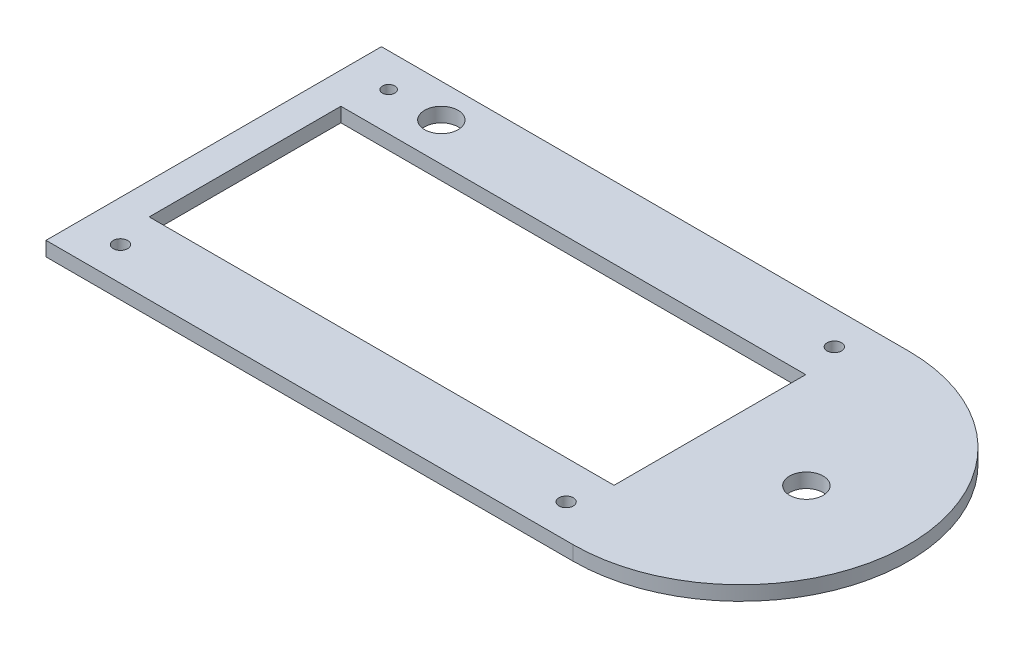
ISO-10303-21;
HEADER;
FILE_DESCRIPTION(('STEP AP214'),'2;1');
FILE_NAME('part.step','',(''),(''),'','','');
FILE_SCHEMA(('AUTOMOTIVE_DESIGN { 1 0 10303 214 1 1 1 1 }'));
ENDSEC;
DATA;
#1=APPLICATION_CONTEXT('core data for automotive mechanical design processes');
#2=APPLICATION_PROTOCOL_DEFINITION('international standard','automotive_design',2000,#1);
#3=PRODUCT_CONTEXT('',#1,'mechanical');
#4=PRODUCT('Part','Part','',(#3));
#5=PRODUCT_RELATED_PRODUCT_CATEGORY('part','',(#4));
#6=PRODUCT_DEFINITION_FORMATION('','',#4);
#7=PRODUCT_DEFINITION_CONTEXT('part definition',#1,'design');
#8=PRODUCT_DEFINITION('design','',#6,#7);
#9=PRODUCT_DEFINITION_SHAPE('','',#8);
#10=(LENGTH_UNIT() NAMED_UNIT(*) SI_UNIT(.MILLI.,.METRE.));
#11=(NAMED_UNIT(*) PLANE_ANGLE_UNIT() SI_UNIT($,.RADIAN.));
#12=(NAMED_UNIT(*) SI_UNIT($,.STERADIAN.) SOLID_ANGLE_UNIT());
#13=UNCERTAINTY_MEASURE_WITH_UNIT(LENGTH_MEASURE(1.E-05),#10,'distance_accuracy_value','');
#14=(GEOMETRIC_REPRESENTATION_CONTEXT(3) GLOBAL_UNCERTAINTY_ASSIGNED_CONTEXT((#13)) GLOBAL_UNIT_ASSIGNED_CONTEXT((#10,
#11,#12)) REPRESENTATION_CONTEXT('',''));
#15=CARTESIAN_POINT('',(0.,0.,0.));
#16=DIRECTION('',(0.,0.,1.));
#17=DIRECTION('',(1.,0.,0.));
#18=AXIS2_PLACEMENT_3D('',#15,#16,#17);
#19=CARTESIAN_POINT('',(0.,3.,-6.97895276201306));
#20=DIRECTION('',(0.,0.,-1.));
#21=DIRECTION('',(-1.,0.,0.));
#22=AXIS2_PLACEMENT_3D('',#19,#20,#21);
#23=PLANE('',#22);
#24=DIRECTION('',(1.,0.,0.));
#25=VECTOR('',#24,1.);
#26=CARTESIAN_POINT('',(0.,0.,-6.97895276201306));
#27=LINE('',#26,#25);
#28=CARTESIAN_POINT('',(-60.8951195522196,0.,-6.97895276201306));
#29=VERTEX_POINT('',#28);
#30=CARTESIAN_POINT('',(36.1048804477804,0.,-6.97895276201306));
#31=VERTEX_POINT('',#30);
#32=EDGE_CURVE('E160',#29,#31,#27,.T.);
#33=ORIENTED_EDGE('',*,*,#32,.T.);
#34=DIRECTION('',(0.,-1.,0.));
#35=VECTOR('',#34,1.);
#36=CARTESIAN_POINT('',(36.1048804477804,3.,-6.97895276201306));
#37=LINE('',#36,#35);
#38=CARTESIAN_POINT('',(36.1048804477804,3.,-6.97895276201306));
#39=VERTEX_POINT('',#38);
#40=EDGE_CURVE('E11',#39,#31,#37,.T.);
#41=ORIENTED_EDGE('',*,*,#40,.F.);
#42=DIRECTION('',(1.,0.,0.));
#43=VECTOR('',#42,1.);
#44=CARTESIAN_POINT('',(0.,3.,-6.97895276201306));
#45=LINE('',#44,#43);
#46=CARTESIAN_POINT('',(-60.8951195522196,3.,-6.97895276201306));
#47=VERTEX_POINT('',#46);
#48=EDGE_CURVE('E113',#47,#39,#45,.T.);
#49=ORIENTED_EDGE('',*,*,#48,.F.);
#50=DIRECTION('',(0.,-1.,0.));
#51=VECTOR('',#50,1.);
#52=CARTESIAN_POINT('',(-60.8951195522196,3.,-6.97895276201306));
#53=LINE('',#52,#51);
#54=EDGE_CURVE('E53',#47,#29,#53,.T.);
#55=ORIENTED_EDGE('',*,*,#54,.T.);
#56=EDGE_LOOP('',(#33,#41,#49,#55));
#57=FACE_BOUND('',#56,.T.);
#58=ADVANCED_FACE('F34',(#57),#23,.F.);
#59=CARTESIAN_POINT('',(36.1048804477804,3.,0.));
#60=DIRECTION('',(1.,0.,0.));
#61=DIRECTION('',(0.,0.,-1.));
#62=AXIS2_PLACEMENT_3D('',#59,#60,#61);
#63=PLANE('',#62);
#64=DIRECTION('',(0.,0.,1.));
#65=VECTOR('',#64,1.);
#66=CARTESIAN_POINT('',(36.1048804477804,0.,0.));
#67=LINE('',#66,#65);
#68=CARTESIAN_POINT('',(36.1048804477804,0.,33.0210472379869));
#69=VERTEX_POINT('',#68);
#70=EDGE_CURVE('E119',#31,#69,#67,.T.);
#71=ORIENTED_EDGE('',*,*,#70,.T.);
#72=DIRECTION('',(0.,-1.,0.));
#73=VECTOR('',#72,1.);
#74=CARTESIAN_POINT('',(36.1048804477804,3.,33.0210472379869));
#75=LINE('',#74,#73);
#76=CARTESIAN_POINT('',(36.1048804477804,3.,33.0210472379869));
#77=VERTEX_POINT('',#76);
#78=EDGE_CURVE('E44',#77,#69,#75,.T.);
#79=ORIENTED_EDGE('',*,*,#78,.F.);
#80=DIRECTION('',(0.,0.,1.));
#81=VECTOR('',#80,1.);
#82=CARTESIAN_POINT('',(36.1048804477804,3.,0.));
#83=LINE('',#82,#81);
#84=EDGE_CURVE('E107',#39,#77,#83,.T.);
#85=ORIENTED_EDGE('',*,*,#84,.F.);
#86=ORIENTED_EDGE('',*,*,#40,.T.);
#87=EDGE_LOOP('',(#71,#79,#85,#86));
#88=FACE_BOUND('',#87,.T.);
#89=ADVANCED_FACE('F118',(#88),#63,.F.);
#90=CARTESIAN_POINT('',(0.,3.,33.0210472379869));
#91=DIRECTION('',(0.,0.,-1.));
#92=DIRECTION('',(-1.,0.,0.));
#93=AXIS2_PLACEMENT_3D('',#90,#91,#92);
#94=PLANE('',#93);
#95=DIRECTION('',(1.,0.,0.));
#96=VECTOR('',#95,1.);
#97=CARTESIAN_POINT('',(0.,0.,33.0210472379869));
#98=LINE('',#97,#96);
#99=CARTESIAN_POINT('',(-60.8951195522196,0.,33.0210472379869));
#100=VERTEX_POINT('',#99);
#101=EDGE_CURVE('E163',#100,#69,#98,.T.);
#102=ORIENTED_EDGE('',*,*,#101,.F.);
#103=DIRECTION('',(0.,-1.,0.));
#104=VECTOR('',#103,1.);
#105=CARTESIAN_POINT('',(-60.8951195522196,3.,33.0210472379869));
#106=LINE('',#105,#104);
#107=CARTESIAN_POINT('',(-60.8951195522196,3.,33.0210472379869));
#108=VERTEX_POINT('',#107);
#109=EDGE_CURVE('E79',#108,#100,#106,.T.);
#110=ORIENTED_EDGE('',*,*,#109,.F.);
#111=DIRECTION('',(1.,0.,0.));
#112=VECTOR('',#111,1.);
#113=CARTESIAN_POINT('',(0.,3.,33.0210472379869));
#114=LINE('',#113,#112);
#115=EDGE_CURVE('E112',#108,#77,#114,.T.);
#116=ORIENTED_EDGE('',*,*,#115,.T.);
#117=ORIENTED_EDGE('',*,*,#78,.T.);
#118=EDGE_LOOP('',(#102,#110,#116,#117));
#119=FACE_BOUND('',#118,.T.);
#120=ADVANCED_FACE('F123',(#119),#94,.T.);
#121=CARTESIAN_POINT('',(42.5682801600808,3.,13.0210472379869));
#122=DIRECTION('',(0.,-1.,0.));
#123=DIRECTION('',(0.,0.,-1.));
#124=AXIS2_PLACEMENT_3D('',#121,#122,#123);
#125=CYLINDRICAL_SURFACE('',#124,35.);
#126=CARTESIAN_POINT('',(42.5682801600808,0.,13.0210472379869));
#127=DIRECTION('',(0.,1.,0.));
#128=DIRECTION('',(0.,0.,1.));
#129=AXIS2_PLACEMENT_3D('',#126,#127,#128);
#130=CIRCLE('',#129,35.);
#131=CARTESIAN_POINT('',(42.5682801600808,0.,-21.9789527620131));
#132=VERTEX_POINT('',#131);
#133=CARTESIAN_POINT('',(42.5682801600808,0.,48.0210472379869));
#134=VERTEX_POINT('',#133);
#135=EDGE_CURVE('E145',#132,#134,#130,.F.);
#136=ORIENTED_EDGE('',*,*,#135,.F.);
#137=DIRECTION('',(0.,-1.,0.));
#138=VECTOR('',#137,1.);
#139=CARTESIAN_POINT('',(42.5682801600808,3.,-21.9789527620131));
#140=LINE('',#139,#138);
#141=CARTESIAN_POINT('',(42.5682801600808,3.,-21.9789527620131));
#142=VERTEX_POINT('',#141);
#143=EDGE_CURVE('E38',#142,#132,#140,.T.);
#144=ORIENTED_EDGE('',*,*,#143,.F.);
#145=CARTESIAN_POINT('',(42.5682801600808,3.,13.0210472379869));
#146=DIRECTION('',(0.,1.,0.));
#147=DIRECTION('',(0.,0.,1.));
#148=AXIS2_PLACEMENT_3D('',#145,#146,#147);
#149=CIRCLE('',#148,35.);
#150=CARTESIAN_POINT('',(42.5682801600808,3.,48.0210472379869));
#151=VERTEX_POINT('',#150);
#152=EDGE_CURVE('E201',#142,#151,#149,.F.);
#153=ORIENTED_EDGE('',*,*,#152,.T.);
#154=DIRECTION('',(0.,-1.,0.));
#155=VECTOR('',#154,1.);
#156=CARTESIAN_POINT('',(42.5682801600808,3.,48.0210472379869));
#157=LINE('',#156,#155);
#158=EDGE_CURVE('E126',#151,#134,#157,.T.);
#159=ORIENTED_EDGE('',*,*,#158,.T.);
#160=EDGE_LOOP('',(#136,#144,#153,#159));
#161=FACE_BOUND('',#160,.T.);
#162=ADVANCED_FACE('F184',(#161),#125,.T.);
#163=CARTESIAN_POINT('',(0.,3.,-21.9789527620131));
#164=DIRECTION('',(0.,0.,-1.));
#165=DIRECTION('',(-1.,0.,0.));
#166=AXIS2_PLACEMENT_3D('',#163,#164,#165);
#167=PLANE('',#166);
#168=DIRECTION('',(1.,0.,0.));
#169=VECTOR('',#168,1.);
#170=CARTESIAN_POINT('',(0.,0.,-21.9789527620131));
#171=LINE('',#170,#169);
#172=CARTESIAN_POINT('',(-67.4317198399193,0.,-21.9789527620131));
#173=VERTEX_POINT('',#172);
#174=EDGE_CURVE('E148',#173,#132,#171,.T.);
#175=ORIENTED_EDGE('',*,*,#174,.F.);
#176=DIRECTION('',(0.,-1.,0.));
#177=VECTOR('',#176,1.);
#178=CARTESIAN_POINT('',(-67.4317198399193,3.,-21.9789527620131));
#179=LINE('',#178,#177);
#180=CARTESIAN_POINT('',(-67.4317198399193,3.,-21.9789527620131));
#181=VERTEX_POINT('',#180);
#182=EDGE_CURVE('E174',#181,#173,#179,.T.);
#183=ORIENTED_EDGE('',*,*,#182,.F.);
#184=DIRECTION('',(1.,0.,0.));
#185=VECTOR('',#184,1.);
#186=CARTESIAN_POINT('',(0.,3.,-21.9789527620131));
#187=LINE('',#186,#185);
#188=EDGE_CURVE('E183',#181,#142,#187,.T.);
#189=ORIENTED_EDGE('',*,*,#188,.T.);
#190=ORIENTED_EDGE('',*,*,#143,.T.);
#191=EDGE_LOOP('',(#175,#183,#189,#190));
#192=FACE_BOUND('',#191,.T.);
#193=ADVANCED_FACE('F181',(#192),#167,.T.);
#194=CARTESIAN_POINT('',(-67.4317198399193,3.,0.));
#195=DIRECTION('',(1.,0.,0.));
#196=DIRECTION('',(0.,0.,-1.));
#197=AXIS2_PLACEMENT_3D('',#194,#195,#196);
#198=PLANE('',#197);
#199=DIRECTION('',(0.,0.,1.));
#200=VECTOR('',#199,1.);
#201=CARTESIAN_POINT('',(-67.4317198399193,0.,0.));
#202=LINE('',#201,#200);
#203=CARTESIAN_POINT('',(-67.4317198399192,0.,48.0210472379869));
#204=VERTEX_POINT('',#203);
#205=EDGE_CURVE('E151',#173,#204,#202,.T.);
#206=ORIENTED_EDGE('',*,*,#205,.T.);
#207=DIRECTION('',(0.,-1.,0.));
#208=VECTOR('',#207,1.);
#209=CARTESIAN_POINT('',(-67.4317198399192,3.,48.0210472379869));
#210=LINE('',#209,#208);
#211=CARTESIAN_POINT('',(-67.4317198399192,3.,48.0210472379869));
#212=VERTEX_POINT('',#211);
#213=EDGE_CURVE('E172',#212,#204,#210,.T.);
#214=ORIENTED_EDGE('',*,*,#213,.F.);
#215=DIRECTION('',(0.,0.,1.));
#216=VECTOR('',#215,1.);
#217=CARTESIAN_POINT('',(-67.4317198399193,3.,0.));
#218=LINE('',#217,#216);
#219=EDGE_CURVE('E192',#181,#212,#218,.T.);
#220=ORIENTED_EDGE('',*,*,#219,.F.);
#221=ORIENTED_EDGE('',*,*,#182,.T.);
#222=EDGE_LOOP('',(#206,#214,#220,#221));
#223=FACE_BOUND('',#222,.T.);
#224=ADVANCED_FACE('F190',(#223),#198,.F.);
#225=CARTESIAN_POINT('',(-58.9317198399192,3.,-14.9789527620131));
#226=DIRECTION('',(0.,-1.,0.));
#227=DIRECTION('',(0.,0.,-1.));
#228=AXIS2_PLACEMENT_3D('',#225,#226,#227);
#229=CYLINDRICAL_SURFACE('',#228,1.29999999999999);
#230=CARTESIAN_POINT('',(-58.9317198399192,3.,-14.9789527620131));
#231=DIRECTION('',(0.,1.,0.));
#232=DIRECTION('',(0.,0.,1.));
#233=AXIS2_PLACEMENT_3D('',#230,#231,#232);
#234=CIRCLE('',#233,1.29999999999999);
#235=CARTESIAN_POINT('',(-58.9317198399192,3.,-13.6789527620131));
#236=VERTEX_POINT('',#235);
#237=EDGE_CURVE('E197',#236,#236,#234,.T.);
#238=ORIENTED_EDGE('',*,*,#237,.T.);
#239=EDGE_LOOP('',(#238));
#240=FACE_BOUND('',#239,.T.);
#241=CARTESIAN_POINT('',(-58.9317198399192,0.,-14.9789527620131));
#242=DIRECTION('',(0.,1.,0.));
#243=DIRECTION('',(0.,0.,1.));
#244=AXIS2_PLACEMENT_3D('',#241,#242,#243);
#245=CIRCLE('',#244,1.29999999999999);
#246=CARTESIAN_POINT('',(-58.9317198399192,0.,-13.6789527620131));
#247=VERTEX_POINT('',#246);
#248=EDGE_CURVE('E157',#247,#247,#245,.T.);
#249=ORIENTED_EDGE('',*,*,#248,.F.);
#250=EDGE_LOOP('',(#249));
#251=FACE_BOUND('',#250,.T.);
#252=ADVANCED_FACE('F208',(#240,#251),#229,.F.);
#253=CARTESIAN_POINT('',(0.,3.,48.0210472379869));
#254=DIRECTION('',(0.,0.,-1.));
#255=DIRECTION('',(-1.,0.,0.));
#256=AXIS2_PLACEMENT_3D('',#253,#254,#255);
#257=PLANE('',#256);
#258=DIRECTION('',(1.,0.,0.));
#259=VECTOR('',#258,1.);
#260=CARTESIAN_POINT('',(0.,0.,48.0210472379869));
#261=LINE('',#260,#259);
#262=EDGE_CURVE('E154',#204,#134,#261,.T.);
#263=ORIENTED_EDGE('',*,*,#262,.T.);
#264=ORIENTED_EDGE('',*,*,#158,.F.);
#265=DIRECTION('',(1.,0.,0.));
#266=VECTOR('',#265,1.);
#267=CARTESIAN_POINT('',(0.,3.,48.0210472379869));
#268=LINE('',#267,#266);
#269=EDGE_CURVE('E195',#212,#151,#268,.T.);
#270=ORIENTED_EDGE('',*,*,#269,.F.);
#271=ORIENTED_EDGE('',*,*,#213,.T.);
#272=EDGE_LOOP('',(#263,#264,#270,#271));
#273=FACE_BOUND('',#272,.T.);
#274=ADVANCED_FACE('F194',(#273),#257,.F.);
#275=CARTESIAN_POINT('',(34.0682801600808,3.,-14.9789527620131));
#276=DIRECTION('',(0.,-1.,0.));
#277=DIRECTION('',(0.,0.,-1.));
#278=AXIS2_PLACEMENT_3D('',#275,#276,#277);
#279=CYLINDRICAL_SURFACE('',#278,1.5);
#280=CARTESIAN_POINT('',(34.0682801600808,3.,-14.9789527620131));
#281=DIRECTION('',(0.,1.,0.));
#282=DIRECTION('',(0.,0.,1.));
#283=AXIS2_PLACEMENT_3D('',#280,#281,#282);
#284=CIRCLE('',#283,1.5);
#285=CARTESIAN_POINT('',(34.0682801600808,3.,-13.4789527620131));
#286=VERTEX_POINT('',#285);
#287=EDGE_CURVE('E284',#286,#286,#284,.T.);
#288=ORIENTED_EDGE('',*,*,#287,.T.);
#289=EDGE_LOOP('',(#288));
#290=FACE_BOUND('',#289,.T.);
#291=CARTESIAN_POINT('',(34.0682801600808,0.,-14.9789527620131));
#292=DIRECTION('',(0.,1.,0.));
#293=DIRECTION('',(0.,0.,1.));
#294=AXIS2_PLACEMENT_3D('',#291,#292,#293);
#295=CIRCLE('',#294,1.5);
#296=CARTESIAN_POINT('',(34.0682801600808,0.,-13.4789527620131));
#297=VERTEX_POINT('',#296);
#298=EDGE_CURVE('E142',#297,#297,#295,.T.);
#299=ORIENTED_EDGE('',*,*,#298,.F.);
#300=EDGE_LOOP('',(#299));
#301=FACE_BOUND('',#300,.T.);
#302=ADVANCED_FACE('F235',(#290,#301),#279,.F.);
#303=CARTESIAN_POINT('',(-58.8951195522196,3.,41.0210352774405));
#304=DIRECTION('',(0.,-1.,0.));
#305=DIRECTION('',(0.,0.,-1.));
#306=AXIS2_PLACEMENT_3D('',#303,#304,#305);
#307=CYLINDRICAL_SURFACE('',#306,1.5);
#308=CARTESIAN_POINT('',(-58.8951195522196,3.,41.0210352774405));
#309=DIRECTION('',(0.,1.,0.));
#310=DIRECTION('',(0.,0.,1.));
#311=AXIS2_PLACEMENT_3D('',#308,#309,#310);
#312=CIRCLE('',#311,1.5);
#313=CARTESIAN_POINT('',(-58.8951195522196,3.,42.5210352774405));
#314=VERTEX_POINT('',#313);
#315=EDGE_CURVE('E277',#314,#314,#312,.T.);
#316=ORIENTED_EDGE('',*,*,#315,.T.);
#317=EDGE_LOOP('',(#316));
#318=FACE_BOUND('',#317,.T.);
#319=CARTESIAN_POINT('',(-58.8951195522196,0.,41.0210352774405));
#320=DIRECTION('',(0.,1.,0.));
#321=DIRECTION('',(0.,0.,1.));
#322=AXIS2_PLACEMENT_3D('',#319,#320,#321);
#323=CIRCLE('',#322,1.5);
#324=CARTESIAN_POINT('',(-58.8951195522196,0.,42.5210352774405));
#325=VERTEX_POINT('',#324);
#326=EDGE_CURVE('E139',#325,#325,#323,.T.);
#327=ORIENTED_EDGE('',*,*,#326,.F.);
#328=EDGE_LOOP('',(#327));
#329=FACE_BOUND('',#328,.T.);
#330=ADVANCED_FACE('F244',(#318,#329),#307,.F.);
#331=CARTESIAN_POINT('',(34.1048804477804,3.,41.0210352774405));
#332=DIRECTION('',(0.,-1.,0.));
#333=DIRECTION('',(0.,0.,-1.));
#334=AXIS2_PLACEMENT_3D('',#331,#332,#333);
#335=CYLINDRICAL_SURFACE('',#334,1.5);
#336=CARTESIAN_POINT('',(34.1048804477804,3.,41.0210352774405));
#337=DIRECTION('',(0.,1.,0.));
#338=DIRECTION('',(0.,0.,1.));
#339=AXIS2_PLACEMENT_3D('',#336,#337,#338);
#340=CIRCLE('',#339,1.5);
#341=CARTESIAN_POINT('',(34.1048804477804,3.,42.5210352774405));
#342=VERTEX_POINT('',#341);
#343=EDGE_CURVE('E274',#342,#342,#340,.T.);
#344=ORIENTED_EDGE('',*,*,#343,.T.);
#345=EDGE_LOOP('',(#344));
#346=FACE_BOUND('',#345,.T.);
#347=CARTESIAN_POINT('',(34.1048804477804,0.,41.0210352774405));
#348=DIRECTION('',(0.,1.,0.));
#349=DIRECTION('',(0.,0.,1.));
#350=AXIS2_PLACEMENT_3D('',#347,#348,#349);
#351=CIRCLE('',#350,1.5);
#352=CARTESIAN_POINT('',(34.1048804477804,0.,42.5210352774405));
#353=VERTEX_POINT('',#352);
#354=EDGE_CURVE('E136',#353,#353,#351,.T.);
#355=ORIENTED_EDGE('',*,*,#354,.F.);
#356=EDGE_LOOP('',(#355));
#357=FACE_BOUND('',#356,.T.);
#358=ADVANCED_FACE('F248',(#346,#357),#335,.F.);
#359=CARTESIAN_POINT('',(56.2429354444259,3.,13.0210472379869));
#360=DIRECTION('',(0.,-1.,0.));
#361=DIRECTION('',(0.,0.,-1.));
#362=AXIS2_PLACEMENT_3D('',#359,#360,#361);
#363=CYLINDRICAL_SURFACE('',#362,3.5);
#364=CARTESIAN_POINT('',(56.2429354444259,3.,13.0210472379869));
#365=DIRECTION('',(0.,1.,0.));
#366=DIRECTION('',(0.,0.,1.));
#367=AXIS2_PLACEMENT_3D('',#364,#365,#366);
#368=CIRCLE('',#367,3.5);
#369=CARTESIAN_POINT('',(56.2429354444259,3.,16.5210472379869));
#370=VERTEX_POINT('',#369);
#371=EDGE_CURVE('E262',#370,#370,#368,.T.);
#372=ORIENTED_EDGE('',*,*,#371,.T.);
#373=EDGE_LOOP('',(#372));
#374=FACE_BOUND('',#373,.T.);
#375=CARTESIAN_POINT('',(56.2429354444259,0.,13.0210472379869));
#376=DIRECTION('',(0.,1.,0.));
#377=DIRECTION('',(0.,0.,1.));
#378=AXIS2_PLACEMENT_3D('',#375,#376,#377);
#379=CIRCLE('',#378,3.5);
#380=CARTESIAN_POINT('',(56.2429354444259,0.,16.5210472379869));
#381=VERTEX_POINT('',#380);
#382=EDGE_CURVE('E133',#381,#381,#379,.T.);
#383=ORIENTED_EDGE('',*,*,#382,.F.);
#384=EDGE_LOOP('',(#383));
#385=FACE_BOUND('',#384,.T.);
#386=ADVANCED_FACE('F251',(#374,#385),#363,.F.);
#387=CARTESIAN_POINT('',(-47.9317198399192,3.,-14.9789527620131));
#388=DIRECTION('',(0.,-1.,0.));
#389=DIRECTION('',(0.,0.,-1.));
#390=AXIS2_PLACEMENT_3D('',#387,#388,#389);
#391=CYLINDRICAL_SURFACE('',#390,3.5);
#392=CARTESIAN_POINT('',(-47.9317198399192,3.,-14.9789527620131));
#393=DIRECTION('',(0.,1.,0.));
#394=DIRECTION('',(0.,0.,1.));
#395=AXIS2_PLACEMENT_3D('',#392,#393,#394);
#396=CIRCLE('',#395,3.5);
#397=CARTESIAN_POINT('',(-47.9317198399192,3.,-11.4789527620131));
#398=VERTEX_POINT('',#397);
#399=EDGE_CURVE('E168',#398,#398,#396,.T.);
#400=ORIENTED_EDGE('',*,*,#399,.T.);
#401=EDGE_LOOP('',(#400));
#402=FACE_BOUND('',#401,.T.);
#403=CARTESIAN_POINT('',(-47.9317198399192,0.,-14.9789527620131));
#404=DIRECTION('',(0.,1.,0.));
#405=DIRECTION('',(0.,0.,1.));
#406=AXIS2_PLACEMENT_3D('',#403,#404,#405);
#407=CIRCLE('',#406,3.5);
#408=CARTESIAN_POINT('',(-47.9317198399192,0.,-11.4789527620131));
#409=VERTEX_POINT('',#408);
#410=EDGE_CURVE('E130',#409,#409,#407,.T.);
#411=ORIENTED_EDGE('',*,*,#410,.F.);
#412=EDGE_LOOP('',(#411));
#413=FACE_BOUND('',#412,.T.);
#414=ADVANCED_FACE('F36',(#402,#413),#391,.F.);
#415=CARTESIAN_POINT('',(-60.8951195522196,3.,0.));
#416=DIRECTION('',(1.,0.,0.));
#417=DIRECTION('',(0.,0.,-1.));
#418=AXIS2_PLACEMENT_3D('',#415,#416,#417);
#419=PLANE('',#418);
#420=DIRECTION('',(0.,0.,1.));
#421=VECTOR('',#420,1.);
#422=CARTESIAN_POINT('',(-60.8951195522196,0.,0.));
#423=LINE('',#422,#421);
#424=EDGE_CURVE('E165',#29,#100,#423,.T.);
#425=ORIENTED_EDGE('',*,*,#424,.F.);
#426=ORIENTED_EDGE('',*,*,#54,.F.);
#427=DIRECTION('',(0.,0.,1.));
#428=VECTOR('',#427,1.);
#429=CARTESIAN_POINT('',(-60.8951195522196,3.,0.));
#430=LINE('',#429,#428);
#431=EDGE_CURVE('E124',#47,#108,#430,.T.);
#432=ORIENTED_EDGE('',*,*,#431,.T.);
#433=ORIENTED_EDGE('',*,*,#109,.T.);
#434=EDGE_LOOP('',(#425,#426,#432,#433));
#435=FACE_BOUND('',#434,.T.);
#436=ADVANCED_FACE('F211',(#435),#419,.T.);
#437=CARTESIAN_POINT('',(0.,3.,0.));
#438=DIRECTION('',(0.,1.,0.));
#439=DIRECTION('',(0.,0.,1.));
#440=AXIS2_PLACEMENT_3D('',#437,#438,#439);
#441=PLANE('',#440);
#442=ORIENTED_EDGE('',*,*,#399,.F.);
#443=EDGE_LOOP('',(#442));
#444=FACE_BOUND('',#443,.T.);
#445=ORIENTED_EDGE('',*,*,#371,.F.);
#446=EDGE_LOOP('',(#445));
#447=FACE_BOUND('',#446,.T.);
#448=ORIENTED_EDGE('',*,*,#343,.F.);
#449=EDGE_LOOP('',(#448));
#450=FACE_BOUND('',#449,.T.);
#451=ORIENTED_EDGE('',*,*,#315,.F.);
#452=EDGE_LOOP('',(#451));
#453=FACE_BOUND('',#452,.T.);
#454=ORIENTED_EDGE('',*,*,#287,.F.);
#455=EDGE_LOOP('',(#454));
#456=FACE_BOUND('',#455,.T.);
#457=ORIENTED_EDGE('',*,*,#152,.F.);
#458=ORIENTED_EDGE('',*,*,#188,.F.);
#459=ORIENTED_EDGE('',*,*,#219,.T.);
#460=ORIENTED_EDGE('',*,*,#269,.T.);
#461=EDGE_LOOP('',(#457,#458,#459,#460));
#462=FACE_BOUND('',#461,.T.);
#463=ORIENTED_EDGE('',*,*,#237,.F.);
#464=EDGE_LOOP('',(#463));
#465=FACE_BOUND('',#464,.T.);
#466=ORIENTED_EDGE('',*,*,#48,.T.);
#467=ORIENTED_EDGE('',*,*,#84,.T.);
#468=ORIENTED_EDGE('',*,*,#115,.F.);
#469=ORIENTED_EDGE('',*,*,#431,.F.);
#470=EDGE_LOOP('',(#466,#467,#468,#469));
#471=FACE_BOUND('',#470,.T.);
#472=ADVANCED_FACE('F109',(#444,#447,#450,#453,#456,#462,#465,#471),#441,.T.);
#473=CARTESIAN_POINT('',(0.,0.,0.));
#474=DIRECTION('',(0.,1.,0.));
#475=DIRECTION('',(0.,0.,1.));
#476=AXIS2_PLACEMENT_3D('',#473,#474,#475);
#477=PLANE('',#476);
#478=ORIENTED_EDGE('',*,*,#410,.T.);
#479=EDGE_LOOP('',(#478));
#480=FACE_BOUND('',#479,.T.);
#481=ORIENTED_EDGE('',*,*,#382,.T.);
#482=EDGE_LOOP('',(#481));
#483=FACE_BOUND('',#482,.T.);
#484=ORIENTED_EDGE('',*,*,#354,.T.);
#485=EDGE_LOOP('',(#484));
#486=FACE_BOUND('',#485,.T.);
#487=ORIENTED_EDGE('',*,*,#326,.T.);
#488=EDGE_LOOP('',(#487));
#489=FACE_BOUND('',#488,.T.);
#490=ORIENTED_EDGE('',*,*,#298,.T.);
#491=EDGE_LOOP('',(#490));
#492=FACE_BOUND('',#491,.T.);
#493=ORIENTED_EDGE('',*,*,#135,.T.);
#494=ORIENTED_EDGE('',*,*,#262,.F.);
#495=ORIENTED_EDGE('',*,*,#205,.F.);
#496=ORIENTED_EDGE('',*,*,#174,.T.);
#497=EDGE_LOOP('',(#493,#494,#495,#496));
#498=FACE_BOUND('',#497,.T.);
#499=ORIENTED_EDGE('',*,*,#248,.T.);
#500=EDGE_LOOP('',(#499));
#501=FACE_BOUND('',#500,.T.);
#502=ORIENTED_EDGE('',*,*,#32,.F.);
#503=ORIENTED_EDGE('',*,*,#424,.T.);
#504=ORIENTED_EDGE('',*,*,#101,.T.);
#505=ORIENTED_EDGE('',*,*,#70,.F.);
#506=EDGE_LOOP('',(#502,#503,#504,#505));
#507=FACE_BOUND('',#506,.T.);
#508=ADVANCED_FACE('F187',(#480,#483,#486,#489,#492,#498,#501,#507),#477,.F.);
#509=CLOSED_SHELL('',(#58,#89,#120,#162,#193,#224,#252,#274,#302,#330,#358,#386,#414,#436,#472,#508));
#510=MANIFOLD_SOLID_BREP('B2',#509);
#511=ADVANCED_BREP_SHAPE_REPRESENTATION('',(#18,#510),#14);
#512=SHAPE_DEFINITION_REPRESENTATION(#9,#511);
ENDSEC;
END-ISO-10303-21;
